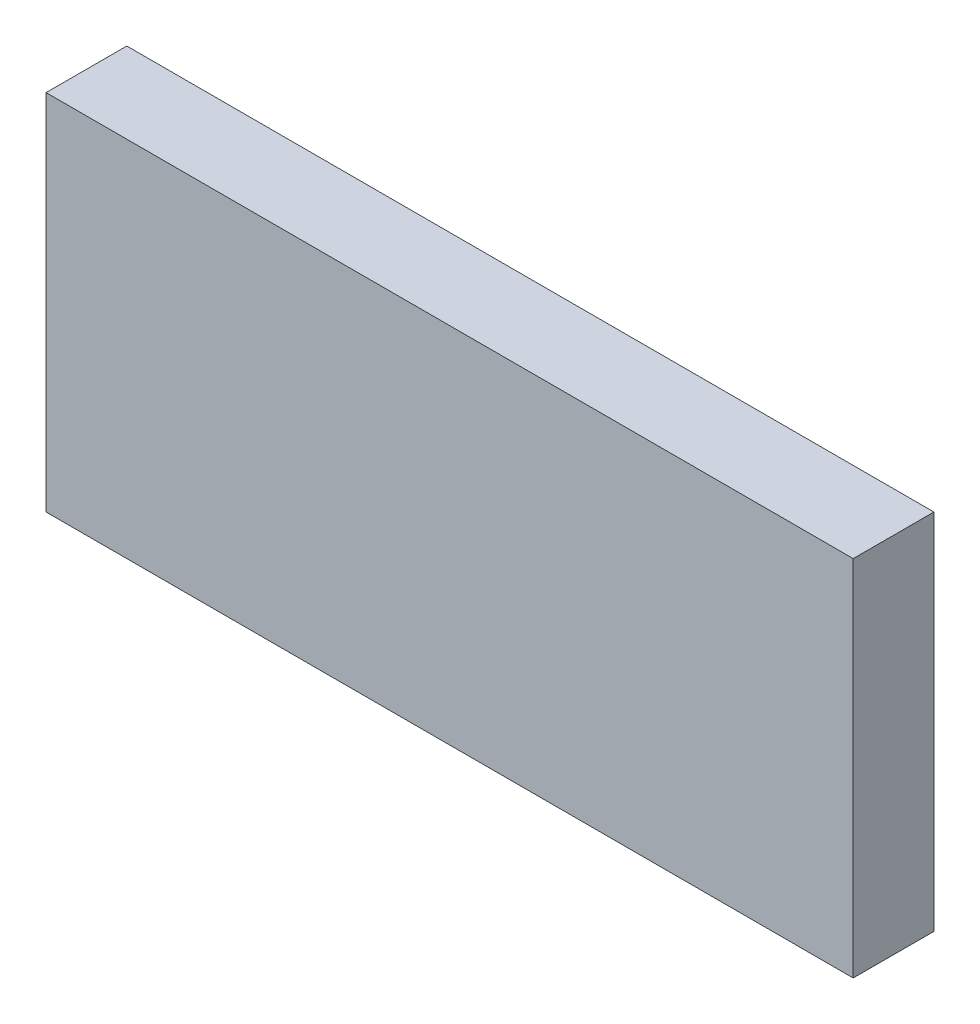
ISO-10303-21;
HEADER;
FILE_DESCRIPTION(('STEP AP214'),'2;1');
FILE_NAME('part.step','',(''),(''),'','','');
FILE_SCHEMA(('AUTOMOTIVE_DESIGN { 1 0 10303 214 1 1 1 1 }'));
ENDSEC;
DATA;
#1=APPLICATION_CONTEXT('core data for automotive mechanical design processes');
#2=APPLICATION_PROTOCOL_DEFINITION('international standard','automotive_design',2000,#1);
#3=PRODUCT_CONTEXT('',#1,'mechanical');
#4=PRODUCT('Part','Part','',(#3));
#5=PRODUCT_RELATED_PRODUCT_CATEGORY('part','',(#4));
#6=PRODUCT_DEFINITION_FORMATION('','',#4);
#7=PRODUCT_DEFINITION_CONTEXT('part definition',#1,'design');
#8=PRODUCT_DEFINITION('design','',#6,#7);
#9=PRODUCT_DEFINITION_SHAPE('','',#8);
#10=(LENGTH_UNIT() NAMED_UNIT(*) SI_UNIT(.MILLI.,.METRE.));
#11=(NAMED_UNIT(*) PLANE_ANGLE_UNIT() SI_UNIT($,.RADIAN.));
#12=(NAMED_UNIT(*) SI_UNIT($,.STERADIAN.) SOLID_ANGLE_UNIT());
#13=UNCERTAINTY_MEASURE_WITH_UNIT(LENGTH_MEASURE(1.E-05),#10,'distance_accuracy_value','');
#14=(GEOMETRIC_REPRESENTATION_CONTEXT(3) GLOBAL_UNCERTAINTY_ASSIGNED_CONTEXT((#13)) GLOBAL_UNIT_ASSIGNED_CONTEXT((#10,
#11,#12)) REPRESENTATION_CONTEXT('',''));
#15=CARTESIAN_POINT('',(0.,0.,0.));
#16=DIRECTION('',(0.,0.,1.));
#17=DIRECTION('',(1.,0.,0.));
#18=AXIS2_PLACEMENT_3D('',#15,#16,#17);
#19=CARTESIAN_POINT('',(-59.707042292251,29.4409090909091,4.));
#20=DIRECTION('',(1.,0.,0.));
#21=DIRECTION('',(0.,0.,-1.));
#22=AXIS2_PLACEMENT_3D('',#19,#20,#21);
#23=PLANE('',#22);
#24=DIRECTION('',(0.,-1.,0.));
#25=VECTOR('',#24,1.);
#26=CARTESIAN_POINT('',(-59.707042292251,29.4409090909091,0.));
#27=LINE('',#26,#25);
#28=CARTESIAN_POINT('',(-59.707042292251,29.4409090909091,0.));
#29=VERTEX_POINT('',#28);
#30=CARTESIAN_POINT('',(-59.707042292251,11.4409090909091,0.));
#31=VERTEX_POINT('',#30);
#32=EDGE_CURVE('E96',#29,#31,#27,.T.);
#33=ORIENTED_EDGE('',*,*,#32,.T.);
#34=DIRECTION('',(0.,0.,-1.));
#35=VECTOR('',#34,1.);
#36=CARTESIAN_POINT('',(-59.707042292251,11.4409090909091,4.));
#37=LINE('',#36,#35);
#38=CARTESIAN_POINT('',(-59.707042292251,11.4409090909091,4.));
#39=VERTEX_POINT('',#38);
#40=EDGE_CURVE('E11',#39,#31,#37,.T.);
#41=ORIENTED_EDGE('',*,*,#40,.F.);
#42=DIRECTION('',(0.,-1.,0.));
#43=VECTOR('',#42,1.);
#44=CARTESIAN_POINT('',(-59.707042292251,29.4409090909091,4.));
#45=LINE('',#44,#43);
#46=CARTESIAN_POINT('',(-59.707042292251,29.4409090909091,4.));
#47=VERTEX_POINT('',#46);
#48=EDGE_CURVE('E82',#47,#39,#45,.T.);
#49=ORIENTED_EDGE('',*,*,#48,.F.);
#50=DIRECTION('',(0.,0.,-1.));
#51=VECTOR('',#50,1.);
#52=CARTESIAN_POINT('',(-59.707042292251,29.4409090909091,4.));
#53=LINE('',#52,#51);
#54=EDGE_CURVE('E49',#47,#29,#53,.T.);
#55=ORIENTED_EDGE('',*,*,#54,.T.);
#56=EDGE_LOOP('',(#33,#41,#49,#55));
#57=FACE_BOUND('',#56,.T.);
#58=ADVANCED_FACE('F33',(#57),#23,.F.);
#59=CARTESIAN_POINT('',(-59.707042292251,11.4409090909091,4.));
#60=DIRECTION('',(0.,1.,0.));
#61=DIRECTION('',(0.,0.,1.));
#62=AXIS2_PLACEMENT_3D('',#59,#60,#61);
#63=PLANE('',#62);
#64=DIRECTION('',(1.,0.,0.));
#65=VECTOR('',#64,1.);
#66=CARTESIAN_POINT('',(-59.707042292251,11.4409090909091,0.));
#67=LINE('',#66,#65);
#68=CARTESIAN_POINT('',(-19.707042292251,11.4409090909091,0.));
#69=VERTEX_POINT('',#68);
#70=EDGE_CURVE('E87',#31,#69,#67,.T.);
#71=ORIENTED_EDGE('',*,*,#70,.T.);
#72=DIRECTION('',(0.,0.,-1.));
#73=VECTOR('',#72,1.);
#74=CARTESIAN_POINT('',(-19.707042292251,11.4409090909091,4.));
#75=LINE('',#74,#73);
#76=CARTESIAN_POINT('',(-19.707042292251,11.4409090909091,4.));
#77=VERTEX_POINT('',#76);
#78=EDGE_CURVE('E41',#77,#69,#75,.T.);
#79=ORIENTED_EDGE('',*,*,#78,.F.);
#80=DIRECTION('',(1.,0.,0.));
#81=VECTOR('',#80,1.);
#82=CARTESIAN_POINT('',(-59.707042292251,11.4409090909091,4.));
#83=LINE('',#82,#81);
#84=EDGE_CURVE('E74',#39,#77,#83,.T.);
#85=ORIENTED_EDGE('',*,*,#84,.F.);
#86=ORIENTED_EDGE('',*,*,#40,.T.);
#87=EDGE_LOOP('',(#71,#79,#85,#86));
#88=FACE_BOUND('',#87,.T.);
#89=ADVANCED_FACE('F86',(#88),#63,.F.);
#90=CARTESIAN_POINT('',(-19.707042292251,29.4409090909091,4.));
#91=DIRECTION('',(1.,0.,0.));
#92=DIRECTION('',(0.,0.,-1.));
#93=AXIS2_PLACEMENT_3D('',#90,#91,#92);
#94=PLANE('',#93);
#95=DIRECTION('',(0.,-1.,0.));
#96=VECTOR('',#95,1.);
#97=CARTESIAN_POINT('',(-19.707042292251,29.4409090909091,0.));
#98=LINE('',#97,#96);
#99=CARTESIAN_POINT('',(-19.707042292251,29.4409090909091,0.));
#100=VERTEX_POINT('',#99);
#101=EDGE_CURVE('E99',#100,#69,#98,.T.);
#102=ORIENTED_EDGE('',*,*,#101,.F.);
#103=DIRECTION('',(0.,0.,-1.));
#104=VECTOR('',#103,1.);
#105=CARTESIAN_POINT('',(-19.707042292251,29.4409090909091,4.));
#106=LINE('',#105,#104);
#107=CARTESIAN_POINT('',(-19.707042292251,29.4409090909091,4.));
#108=VERTEX_POINT('',#107);
#109=EDGE_CURVE('E63',#108,#100,#106,.T.);
#110=ORIENTED_EDGE('',*,*,#109,.F.);
#111=DIRECTION('',(0.,-1.,0.));
#112=VECTOR('',#111,1.);
#113=CARTESIAN_POINT('',(-19.707042292251,29.4409090909091,4.));
#114=LINE('',#113,#112);
#115=EDGE_CURVE('E81',#108,#77,#114,.T.);
#116=ORIENTED_EDGE('',*,*,#115,.T.);
#117=ORIENTED_EDGE('',*,*,#78,.T.);
#118=EDGE_LOOP('',(#102,#110,#116,#117));
#119=FACE_BOUND('',#118,.T.);
#120=ADVANCED_FACE('F90',(#119),#94,.T.);
#121=CARTESIAN_POINT('',(-59.707042292251,29.4409090909091,4.));
#122=DIRECTION('',(0.,1.,0.));
#123=DIRECTION('',(0.,0.,1.));
#124=AXIS2_PLACEMENT_3D('',#121,#122,#123);
#125=PLANE('',#124);
#126=DIRECTION('',(1.,0.,0.));
#127=VECTOR('',#126,1.);
#128=CARTESIAN_POINT('',(-59.707042292251,29.4409090909091,0.));
#129=LINE('',#128,#127);
#130=EDGE_CURVE('E101',#29,#100,#129,.T.);
#131=ORIENTED_EDGE('',*,*,#130,.F.);
#132=ORIENTED_EDGE('',*,*,#54,.F.);
#133=DIRECTION('',(1.,0.,0.));
#134=VECTOR('',#133,1.);
#135=CARTESIAN_POINT('',(-59.707042292251,29.4409090909091,4.));
#136=LINE('',#135,#134);
#137=EDGE_CURVE('E91',#47,#108,#136,.T.);
#138=ORIENTED_EDGE('',*,*,#137,.T.);
#139=ORIENTED_EDGE('',*,*,#109,.T.);
#140=EDGE_LOOP('',(#131,#132,#138,#139));
#141=FACE_BOUND('',#140,.T.);
#142=ADVANCED_FACE('F107',(#141),#125,.T.);
#143=CARTESIAN_POINT('',(0.,0.,4.));
#144=DIRECTION('',(0.,0.,1.));
#145=DIRECTION('',(1.,0.,0.));
#146=AXIS2_PLACEMENT_3D('',#143,#144,#145);
#147=PLANE('',#146);
#148=ORIENTED_EDGE('',*,*,#48,.T.);
#149=ORIENTED_EDGE('',*,*,#84,.T.);
#150=ORIENTED_EDGE('',*,*,#115,.F.);
#151=ORIENTED_EDGE('',*,*,#137,.F.);
#152=EDGE_LOOP('',(#148,#149,#150,#151));
#153=FACE_BOUND('',#152,.T.);
#154=ADVANCED_FACE('F78',(#153),#147,.T.);
#155=CARTESIAN_POINT('',(0.,0.,0.));
#156=DIRECTION('',(0.,0.,1.));
#157=DIRECTION('',(1.,0.,0.));
#158=AXIS2_PLACEMENT_3D('',#155,#156,#157);
#159=PLANE('',#158);
#160=ORIENTED_EDGE('',*,*,#32,.F.);
#161=ORIENTED_EDGE('',*,*,#130,.T.);
#162=ORIENTED_EDGE('',*,*,#101,.T.);
#163=ORIENTED_EDGE('',*,*,#70,.F.);
#164=EDGE_LOOP('',(#160,#161,#162,#163));
#165=FACE_BOUND('',#164,.T.);
#166=ADVANCED_FACE('F106',(#165),#159,.F.);
#167=CLOSED_SHELL('',(#58,#89,#120,#142,#154,#166));
#168=MANIFOLD_SOLID_BREP('B2',#167);
#169=ADVANCED_BREP_SHAPE_REPRESENTATION('',(#18,#168),#14);
#170=SHAPE_DEFINITION_REPRESENTATION(#9,#169);
ENDSEC;
END-ISO-10303-21;
